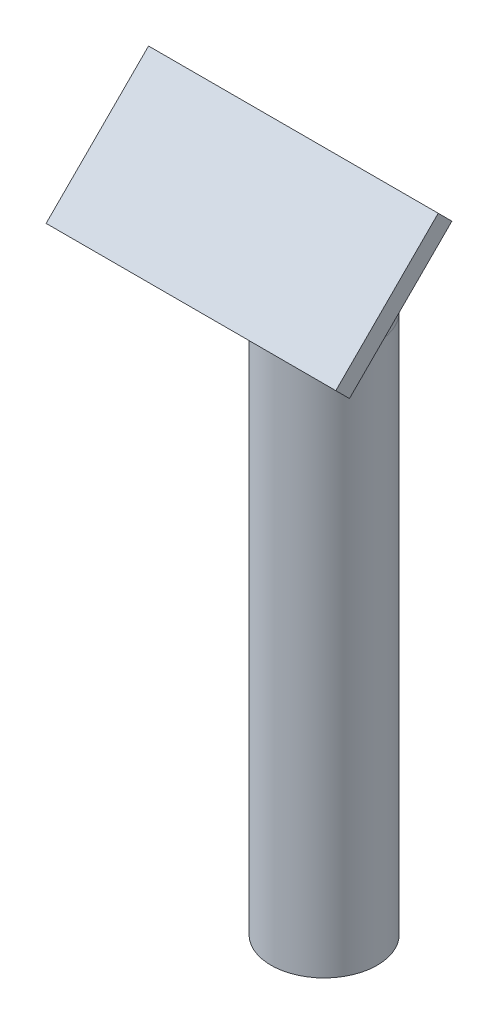
ISO-10303-21;
HEADER;
FILE_DESCRIPTION(('STEP AP214'),'2;1');
FILE_NAME('part.step','',(''),(''),'','','');
FILE_SCHEMA(('AUTOMOTIVE_DESIGN { 1 0 10303 214 1 1 1 1 }'));
ENDSEC;
DATA;
#1=APPLICATION_CONTEXT('core data for automotive mechanical design processes');
#2=APPLICATION_PROTOCOL_DEFINITION('international standard','automotive_design',2000,#1);
#3=PRODUCT_CONTEXT('',#1,'mechanical');
#4=PRODUCT('Part','Part','',(#3));
#5=PRODUCT_RELATED_PRODUCT_CATEGORY('part','',(#4));
#6=PRODUCT_DEFINITION_FORMATION('','',#4);
#7=PRODUCT_DEFINITION_CONTEXT('part definition',#1,'design');
#8=PRODUCT_DEFINITION('design','',#6,#7);
#9=PRODUCT_DEFINITION_SHAPE('','',#8);
#10=(LENGTH_UNIT() NAMED_UNIT(*) SI_UNIT(.MILLI.,.METRE.));
#11=(NAMED_UNIT(*) PLANE_ANGLE_UNIT() SI_UNIT($,.RADIAN.));
#12=(NAMED_UNIT(*) SI_UNIT($,.STERADIAN.) SOLID_ANGLE_UNIT());
#13=UNCERTAINTY_MEASURE_WITH_UNIT(LENGTH_MEASURE(1.E-05),#10,'distance_accuracy_value','');
#14=(GEOMETRIC_REPRESENTATION_CONTEXT(3) GLOBAL_UNCERTAINTY_ASSIGNED_CONTEXT((#13)) GLOBAL_UNIT_ASSIGNED_CONTEXT((#10,
#11,#12)) REPRESENTATION_CONTEXT('',''));
#15=CARTESIAN_POINT('',(0.,0.,0.));
#16=DIRECTION('',(0.,0.,1.));
#17=DIRECTION('',(1.,0.,0.));
#18=AXIS2_PLACEMENT_3D('',#15,#16,#17);
#19=CARTESIAN_POINT('',(0.,-1.11022302462516E-13,-1.11022302462516E-13));
#20=DIRECTION('',(0.,-1.,0.));
#21=DIRECTION('',(0.,0.,-1.));
#22=AXIS2_PLACEMENT_3D('',#19,#20,#21);
#23=PLANE('',#22);
#24=CARTESIAN_POINT('',(0.,-1.11022302462516E-13,-1.11022302462516E-13));
#25=DIRECTION('',(0.,-1.,0.));
#26=DIRECTION('',(0.,0.,-1.));
#27=AXIS2_PLACEMENT_3D('',#24,#25,#26);
#28=CIRCLE('',#27,53.);
#29=CARTESIAN_POINT('',(0.,-3.78752584850872E-13,-53.0000000000001));
#30=VERTEX_POINT('',#29);
#31=EDGE_CURVE('E124',#30,#30,#28,.T.);
#32=ORIENTED_EDGE('',*,*,#31,.F.);
#33=EDGE_LOOP('',(#32));
#34=FACE_BOUND('',#33,.T.);
#35=CARTESIAN_POINT('',(0.,-1.11022302462516E-13,-1.11022302462516E-13));
#36=DIRECTION('',(0.,-1.,0.));
#37=DIRECTION('',(0.,0.,-1.));
#38=AXIS2_PLACEMENT_3D('',#35,#36,#37);
#39=CIRCLE('',#38,55.);
#40=CARTESIAN_POINT('',(0.,-3.88855614374961E-13,-55.0000000000001));
#41=VERTEX_POINT('',#40);
#42=EDGE_CURVE('E136',#41,#41,#39,.T.);
#43=ORIENTED_EDGE('',*,*,#42,.T.);
#44=EDGE_LOOP('',(#43));
#45=FACE_BOUND('',#44,.T.);
#46=ADVANCED_FACE('F45',(#34,#45),#23,.T.);
#47=CARTESIAN_POINT('',(0.,-1.11022302462516E-13,-1.11022302462516E-13));
#48=DIRECTION('',(0.,1.,0.));
#49=DIRECTION('',(0.,0.,1.));
#50=AXIS2_PLACEMENT_3D('',#47,#48,#49);
#51=CYLINDRICAL_SURFACE('',#50,55.);
#52=CARTESIAN_POINT('',(0.,558.57864376269,-1.11022302462516E-13));
#53=DIRECTION('',(0.,-1.,0.));
#54=DIRECTION('',(0.,0.,-1.));
#55=AXIS2_PLACEMENT_3D('',#52,#53,#54);
#56=CIRCLE('',#55,55.);
#57=CARTESIAN_POINT('',(0.,558.578643762689,-55.));
#58=VERTEX_POINT('',#57);
#59=EDGE_CURVE('E53',#58,#58,#56,.T.);
#60=ORIENTED_EDGE('',*,*,#59,.T.);
#61=EDGE_LOOP('',(#60));
#62=FACE_BOUND('',#61,.T.);
#63=ORIENTED_EDGE('',*,*,#42,.F.);
#64=EDGE_LOOP('',(#63));
#65=FACE_BOUND('',#64,.T.);
#66=ADVANCED_FACE('F141',(#62,#65),#51,.T.);
#67=CARTESIAN_POINT('',(0.,558.57864376269,100.));
#68=DIRECTION('',(1.,0.,0.));
#69=DIRECTION('',(0.,0.,-1.));
#70=AXIS2_PLACEMENT_3D('',#67,#68,#69);
#71=TOROIDAL_SURFACE('',#70,100.,55.);
#72=CARTESIAN_POINT('',(0.,629.289321881346,29.2893218813427));
#73=DIRECTION('',(0.,-0.707106781186549,-0.707106781186546));
#74=DIRECTION('',(0.,0.707106781186546,-0.707106781186549));
#75=AXIS2_PLACEMENT_3D('',#72,#73,#74);
#76=CIRCLE('',#75,55.);
#77=CARTESIAN_POINT('',(0.,668.180194846604,-9.60155108391622));
#78=VERTEX_POINT('',#77);
#79=EDGE_CURVE('E12',#78,#78,#76,.T.);
#80=CARTESIAN_POINT('',(0.,558.57864376269,100.));
#81=DIRECTION('',(1.,0.,0.));
#82=DIRECTION('',(0.,0.,-1.));
#83=AXIS2_PLACEMENT_3D('',#80,#81,#82);
#84=CIRCLE('',#83,155.);
#85=EDGE_CURVE('',#58,#78,#84,.T.);
#86=ORIENTED_EDGE('',*,*,#59,.F.);
#87=ORIENTED_EDGE('',*,*,#79,.T.);
#88=ORIENTED_EDGE('',*,*,#85,.T.);
#89=ORIENTED_EDGE('',*,*,#85,.F.);
#90=EDGE_LOOP('',(#86,#88,#87,#89));
#91=FACE_BOUND('',#90,.T.);
#92=ADVANCED_FACE('F144',(#91),#71,.T.);
#93=CARTESIAN_POINT('',(0.,629.289321881346,29.2893218813456));
#94=DIRECTION('',(0.,0.707106781186545,0.70710678118655));
#95=DIRECTION('',(0.,-0.70710678118655,0.707106781186545));
#96=AXIS2_PLACEMENT_3D('',#93,#94,#95);
#97=CYLINDRICAL_SURFACE('',#96,55.);
#98=CARTESIAN_POINT('',(0.,670.710678118655,70.7106781186549));
#99=DIRECTION('',(0.,-0.707106781186549,-0.707106781186546));
#100=DIRECTION('',(0.,0.707106781186546,-0.707106781186549));
#101=AXIS2_PLACEMENT_3D('',#98,#99,#100);
#102=CIRCLE('',#101,55.);
#103=CARTESIAN_POINT('',(0.,709.601551083915,31.8198051533947));
#104=VERTEX_POINT('',#103);
#105=EDGE_CURVE('E121',#104,#104,#102,.T.);
#106=ORIENTED_EDGE('',*,*,#105,.T.);
#107=EDGE_LOOP('',(#106));
#108=FACE_BOUND('',#107,.T.);
#109=ORIENTED_EDGE('',*,*,#79,.F.);
#110=EDGE_LOOP('',(#109));
#111=FACE_BOUND('',#110,.T.);
#112=ADVANCED_FACE('F146',(#108,#111),#97,.T.);
#113=CARTESIAN_POINT('',(0.,-1.11022302462516E-13,-1.11022302462516E-13));
#114=DIRECTION('',(0.,1.,0.));
#115=DIRECTION('',(0.,0.,1.));
#116=AXIS2_PLACEMENT_3D('',#113,#114,#115);
#117=CYLINDRICAL_SURFACE('',#116,53.);
#118=CARTESIAN_POINT('',(0.,558.578643762689,-1.11022302462516E-13));
#119=DIRECTION('',(0.,1.,0.));
#120=DIRECTION('',(0.,0.,1.));
#121=AXIS2_PLACEMENT_3D('',#118,#119,#120);
#122=CIRCLE('',#121,53.);
#123=CARTESIAN_POINT('',(0.,558.578643762689,-53.));
#124=VERTEX_POINT('',#123);
#125=EDGE_CURVE('E125',#124,#124,#122,.F.);
#126=ORIENTED_EDGE('',*,*,#125,.F.);
#127=EDGE_LOOP('',(#126));
#128=FACE_BOUND('',#127,.T.);
#129=ORIENTED_EDGE('',*,*,#31,.T.);
#130=EDGE_LOOP('',(#129));
#131=FACE_BOUND('',#130,.T.);
#132=ADVANCED_FACE('F153',(#128,#131),#117,.F.);
#133=CARTESIAN_POINT('',(0.,558.57864376269,100.));
#134=DIRECTION('',(1.,0.,0.));
#135=DIRECTION('',(0.,0.,-1.));
#136=AXIS2_PLACEMENT_3D('',#133,#134,#135);
#137=TOROIDAL_SURFACE('',#136,100.,53.);
#138=CARTESIAN_POINT('',(0.,629.289321881343,29.2893218813434));
#139=DIRECTION('',(0.,-0.707106781186566,-0.707106781186529));
#140=DIRECTION('',(0.,0.707106781186529,-0.707106781186566));
#141=AXIS2_PLACEMENT_3D('',#138,#139,#140);
#142=CIRCLE('',#141,53.);
#143=CARTESIAN_POINT('',(0.,666.765981284229,-8.18733752154452));
#144=VERTEX_POINT('',#143);
#145=EDGE_CURVE('E128',#144,#144,#142,.T.);
#146=CARTESIAN_POINT('',(0.,558.57864376269,100.));
#147=DIRECTION('',(1.,0.,0.));
#148=DIRECTION('',(0.,0.,-1.));
#149=AXIS2_PLACEMENT_3D('',#146,#147,#148);
#150=CIRCLE('',#149,153.);
#151=EDGE_CURVE('',#124,#144,#150,.T.);
#152=ORIENTED_EDGE('',*,*,#125,.T.);
#153=ORIENTED_EDGE('',*,*,#145,.F.);
#154=ORIENTED_EDGE('',*,*,#151,.T.);
#155=ORIENTED_EDGE('',*,*,#151,.F.);
#156=EDGE_LOOP('',(#152,#154,#153,#155));
#157=FACE_BOUND('',#156,.T.);
#158=ADVANCED_FACE('F161',(#157),#137,.F.);
#159=CARTESIAN_POINT('',(0.,629.289321881346,29.2893218813456));
#160=DIRECTION('',(0.,0.707106781186545,0.70710678118655));
#161=DIRECTION('',(0.,-0.70710678118655,0.707106781186545));
#162=AXIS2_PLACEMENT_3D('',#159,#160,#161);
#163=CYLINDRICAL_SURFACE('',#162,53.);
#164=CARTESIAN_POINT('',(0.,670.710678118655,70.7106781186548));
#165=DIRECTION('',(0.,-0.707106781186549,-0.707106781186546));
#166=DIRECTION('',(0.,0.707106781186546,-0.707106781186549));
#167=AXIS2_PLACEMENT_3D('',#164,#165,#166);
#168=CIRCLE('',#167,53.);
#169=CARTESIAN_POINT('',(0.,708.187337521541,33.2340187157677));
#170=VERTEX_POINT('',#169);
#171=EDGE_CURVE('E131',#170,#170,#168,.T.);
#172=ORIENTED_EDGE('',*,*,#171,.F.);
#173=EDGE_LOOP('',(#172));
#174=FACE_BOUND('',#173,.T.);
#175=ORIENTED_EDGE('',*,*,#145,.T.);
#176=EDGE_LOOP('',(#175));
#177=FACE_BOUND('',#176,.T.);
#178=ADVANCED_FACE('F157',(#174,#177),#163,.F.);
#179=CARTESIAN_POINT('',(0.,370.710678118656,370.710678118655));
#180=DIRECTION('',(0.,-0.707106781186549,-0.707106781186546));
#181=DIRECTION('',(0.,0.707106781186546,-0.707106781186549));
#182=AXIS2_PLACEMENT_3D('',#179,#180,#181);
#183=PLANE('',#182);
#184=ORIENTED_EDGE('',*,*,#171,.T.);
#185=EDGE_LOOP('',(#184));
#186=FACE_BOUND('',#185,.T.);
#187=ADVANCED_FACE('F160',(#186),#183,.T.);
#188=CARTESIAN_POINT('',(150.,631.819805153395,137.885822331377));
#189=DIRECTION('',(-1.,0.,0.));
#190=DIRECTION('',(0.,0.,1.));
#191=AXIS2_PLACEMENT_3D('',#188,#189,#190);
#192=PLANE('',#191);
#193=DIRECTION('',(0.,0.707106781186546,-0.707106781186549));
#194=VECTOR('',#193,1.);
#195=CARTESIAN_POINT('',(150.,617.677669529664,123.743686707646));
#196=LINE('',#195,#194);
#197=CARTESIAN_POINT('',(150.,617.677669529664,123.743686707646));
#198=VERTEX_POINT('',#197);
#199=CARTESIAN_POINT('',(150.,723.743686707646,17.6776695296634));
#200=VERTEX_POINT('',#199);
#201=EDGE_CURVE('E112',#198,#200,#196,.T.);
#202=ORIENTED_EDGE('',*,*,#201,.T.);
#203=DIRECTION('',(0.,-0.707106781186549,-0.707106781186546));
#204=VECTOR('',#203,1.);
#205=CARTESIAN_POINT('',(150.,737.885822331377,31.8198051533944));
#206=LINE('',#205,#204);
#207=CARTESIAN_POINT('',(150.,737.885822331377,31.8198051533944));
#208=VERTEX_POINT('',#207);
#209=EDGE_CURVE('E103',#208,#200,#206,.T.);
#210=ORIENTED_EDGE('',*,*,#209,.F.);
#211=DIRECTION('',(0.,0.707106781186546,-0.707106781186549));
#212=VECTOR('',#211,1.);
#213=CARTESIAN_POINT('',(150.,631.819805153395,137.885822331377));
#214=LINE('',#213,#212);
#215=CARTESIAN_POINT('',(150.,631.819805153395,137.885822331377));
#216=VERTEX_POINT('',#215);
#217=EDGE_CURVE('E97',#216,#208,#214,.T.);
#218=ORIENTED_EDGE('',*,*,#217,.F.);
#219=DIRECTION('',(0.,-0.707106781186549,-0.707106781186546));
#220=VECTOR('',#219,1.);
#221=CARTESIAN_POINT('',(150.,631.819805153395,137.885822331377));
#222=LINE('',#221,#220);
#223=EDGE_CURVE('E108',#216,#198,#222,.T.);
#224=ORIENTED_EDGE('',*,*,#223,.T.);
#225=EDGE_LOOP('',(#202,#210,#218,#224));
#226=FACE_BOUND('',#225,.T.);
#227=ADVANCED_FACE('F169',(#226),#192,.F.);
#228=CARTESIAN_POINT('',(-150.,737.885822331377,31.8198051533944));
#229=DIRECTION('',(0.,-0.707106781186546,0.707106781186549));
#230=DIRECTION('',(0.,-0.707106781186549,-0.707106781186546));
#231=AXIS2_PLACEMENT_3D('',#228,#229,#230);
#232=PLANE('',#231);
#233=DIRECTION('',(-1.,0.,0.));
#234=VECTOR('',#233,1.);
#235=CARTESIAN_POINT('',(-150.,723.743686707646,17.6776695296634));
#236=LINE('',#235,#234);
#237=CARTESIAN_POINT('',(-150.,723.743686707646,17.6776695296634));
#238=VERTEX_POINT('',#237);
#239=EDGE_CURVE('E102',#200,#238,#236,.T.);
#240=ORIENTED_EDGE('',*,*,#239,.T.);
#241=DIRECTION('',(0.,-0.707106781186549,-0.707106781186546));
#242=VECTOR('',#241,1.);
#243=CARTESIAN_POINT('',(-150.,737.885822331377,31.8198051533944));
#244=LINE('',#243,#242);
#245=CARTESIAN_POINT('',(-150.,737.885822331377,31.8198051533944));
#246=VERTEX_POINT('',#245);
#247=EDGE_CURVE('E100',#246,#238,#244,.T.);
#248=ORIENTED_EDGE('',*,*,#247,.F.);
#249=DIRECTION('',(-1.,0.,0.));
#250=VECTOR('',#249,1.);
#251=CARTESIAN_POINT('',(-150.,737.885822331377,31.8198051533944));
#252=LINE('',#251,#250);
#253=EDGE_CURVE('E92',#208,#246,#252,.T.);
#254=ORIENTED_EDGE('',*,*,#253,.F.);
#255=ORIENTED_EDGE('',*,*,#209,.T.);
#256=EDGE_LOOP('',(#240,#248,#254,#255));
#257=FACE_BOUND('',#256,.T.);
#258=ADVANCED_FACE('F101',(#257),#232,.F.);
#259=CARTESIAN_POINT('',(-150.,631.819805153395,137.885822331377));
#260=DIRECTION('',(1.,0.,0.));
#261=DIRECTION('',(0.,0.,-1.));
#262=AXIS2_PLACEMENT_3D('',#259,#260,#261);
#263=PLANE('',#262);
#264=DIRECTION('',(0.,-0.707106781186546,0.707106781186549));
#265=VECTOR('',#264,1.);
#266=CARTESIAN_POINT('',(-150.,617.677669529664,123.743686707646));
#267=LINE('',#266,#265);
#268=CARTESIAN_POINT('',(-150.,617.677669529664,123.743686707646));
#269=VERTEX_POINT('',#268);
#270=EDGE_CURVE('E78',#238,#269,#267,.T.);
#271=ORIENTED_EDGE('',*,*,#270,.T.);
#272=DIRECTION('',(0.,-0.707106781186549,-0.707106781186546));
#273=VECTOR('',#272,1.);
#274=CARTESIAN_POINT('',(-150.,631.819805153395,137.885822331377));
#275=LINE('',#274,#273);
#276=CARTESIAN_POINT('',(-150.,631.819805153395,137.885822331377));
#277=VERTEX_POINT('',#276);
#278=EDGE_CURVE('E104',#277,#269,#275,.T.);
#279=ORIENTED_EDGE('',*,*,#278,.F.);
#280=DIRECTION('',(0.,-0.707106781186546,0.707106781186549));
#281=VECTOR('',#280,1.);
#282=CARTESIAN_POINT('',(-150.,631.819805153395,137.885822331377));
#283=LINE('',#282,#281);
#284=EDGE_CURVE('E95',#246,#277,#283,.T.);
#285=ORIENTED_EDGE('',*,*,#284,.F.);
#286=ORIENTED_EDGE('',*,*,#247,.T.);
#287=EDGE_LOOP('',(#271,#279,#285,#286));
#288=FACE_BOUND('',#287,.T.);
#289=ADVANCED_FACE('F106',(#288),#263,.F.);
#290=CARTESIAN_POINT('',(-150.,631.819805153395,137.885822331377));
#291=DIRECTION('',(0.,0.707106781186546,-0.707106781186549));
#292=DIRECTION('',(0.,0.707106781186549,0.707106781186546));
#293=AXIS2_PLACEMENT_3D('',#290,#291,#292);
#294=PLANE('',#293);
#295=DIRECTION('',(1.,0.,0.));
#296=VECTOR('',#295,1.);
#297=CARTESIAN_POINT('',(-150.,617.677669529664,123.743686707646));
#298=LINE('',#297,#296);
#299=EDGE_CURVE('E84',#269,#198,#298,.T.);
#300=ORIENTED_EDGE('',*,*,#299,.T.);
#301=ORIENTED_EDGE('',*,*,#223,.F.);
#302=DIRECTION('',(1.,0.,0.));
#303=VECTOR('',#302,1.);
#304=CARTESIAN_POINT('',(-150.,631.819805153395,137.885822331377));
#305=LINE('',#304,#303);
#306=EDGE_CURVE('E61',#277,#216,#305,.T.);
#307=ORIENTED_EDGE('',*,*,#306,.F.);
#308=ORIENTED_EDGE('',*,*,#278,.T.);
#309=EDGE_LOOP('',(#300,#301,#307,#308));
#310=FACE_BOUND('',#309,.T.);
#311=ADVANCED_FACE('F177',(#310),#294,.F.);
#312=CARTESIAN_POINT('',(0.,384.852813742387,384.852813742385));
#313=DIRECTION('',(0.,-0.707106781186549,-0.707106781186546));
#314=DIRECTION('',(0.,0.707106781186546,-0.707106781186549));
#315=AXIS2_PLACEMENT_3D('',#312,#313,#314);
#316=PLANE('',#315);
#317=ORIENTED_EDGE('',*,*,#217,.T.);
#318=ORIENTED_EDGE('',*,*,#253,.T.);
#319=ORIENTED_EDGE('',*,*,#284,.T.);
#320=ORIENTED_EDGE('',*,*,#306,.T.);
#321=EDGE_LOOP('',(#317,#318,#319,#320));
#322=FACE_BOUND('',#321,.T.);
#323=ADVANCED_FACE('F93',(#322),#316,.F.);
#324=ORIENTED_EDGE('',*,*,#105,.F.);
#325=EDGE_LOOP('',(#324));
#326=FACE_BOUND('',#325,.T.);
#327=ORIENTED_EDGE('',*,*,#201,.F.);
#328=ORIENTED_EDGE('',*,*,#299,.F.);
#329=ORIENTED_EDGE('',*,*,#270,.F.);
#330=ORIENTED_EDGE('',*,*,#239,.F.);
#331=EDGE_LOOP('',(#327,#328,#329,#330));
#332=FACE_BOUND('',#331,.T.);
#333=ADVANCED_FACE('F180',(#326,#332),#183,.T.);
#334=CLOSED_SHELL('',(#46,#66,#92,#112,#132,#158,#178,#187,#227,#258,#289,#311,#323,#333));
#335=MANIFOLD_SOLID_BREP('B2',#334);
#336=ADVANCED_BREP_SHAPE_REPRESENTATION('',(#18,#335),#14);
#337=SHAPE_DEFINITION_REPRESENTATION(#9,#336);
ENDSEC;
END-ISO-10303-21;
